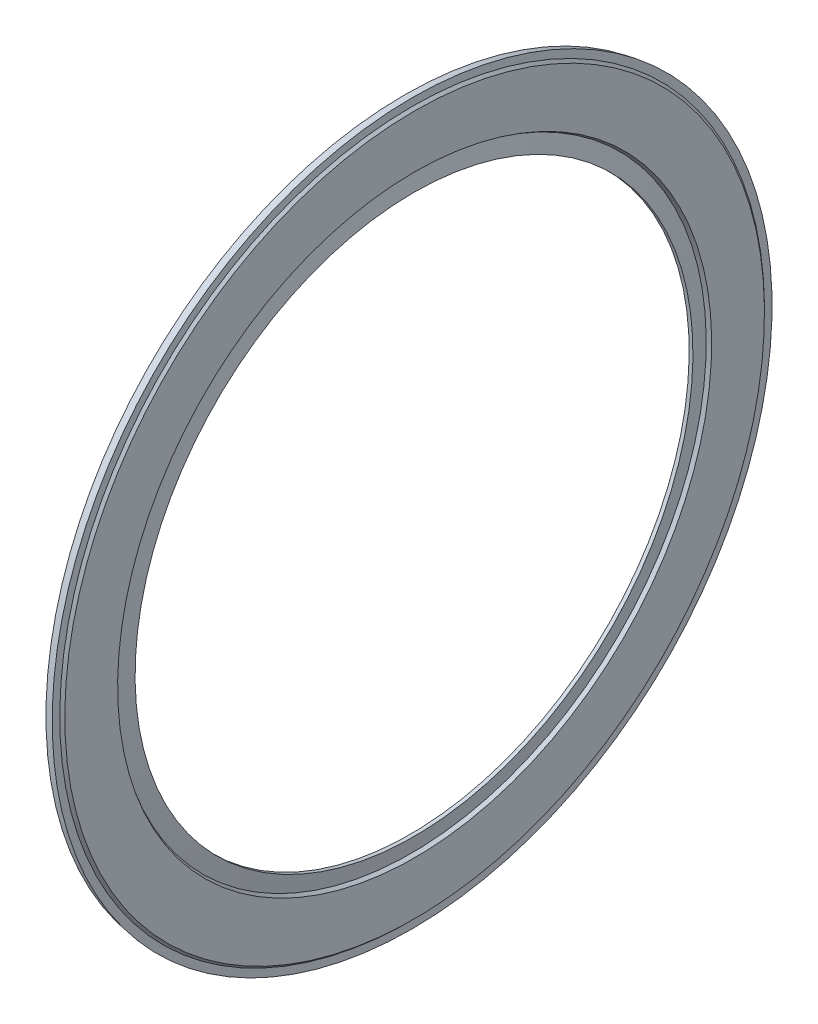
ISO-10303-21;
HEADER;
FILE_DESCRIPTION(('STEP AP214'),'2;1');
FILE_NAME('part.step','',(''),(''),'','','');
FILE_SCHEMA(('AUTOMOTIVE_DESIGN { 1 0 10303 214 1 1 1 1 }'));
ENDSEC;
DATA;
#1=APPLICATION_CONTEXT('core data for automotive mechanical design processes');
#2=APPLICATION_PROTOCOL_DEFINITION('international standard','automotive_design',2000,#1);
#3=PRODUCT_CONTEXT('',#1,'mechanical');
#4=PRODUCT('Part','Part','',(#3));
#5=PRODUCT_RELATED_PRODUCT_CATEGORY('part','',(#4));
#6=PRODUCT_DEFINITION_FORMATION('','',#4);
#7=PRODUCT_DEFINITION_CONTEXT('part definition',#1,'design');
#8=PRODUCT_DEFINITION('design','',#6,#7);
#9=PRODUCT_DEFINITION_SHAPE('','',#8);
#10=(LENGTH_UNIT() NAMED_UNIT(*) SI_UNIT(.MILLI.,.METRE.));
#11=(NAMED_UNIT(*) PLANE_ANGLE_UNIT() SI_UNIT($,.RADIAN.));
#12=(NAMED_UNIT(*) SI_UNIT($,.STERADIAN.) SOLID_ANGLE_UNIT());
#13=UNCERTAINTY_MEASURE_WITH_UNIT(LENGTH_MEASURE(1.E-05),#10,'distance_accuracy_value','');
#14=(GEOMETRIC_REPRESENTATION_CONTEXT(3) GLOBAL_UNCERTAINTY_ASSIGNED_CONTEXT((#13)) GLOBAL_UNIT_ASSIGNED_CONTEXT((#10,
#11,#12)) REPRESENTATION_CONTEXT('',''));
#15=CARTESIAN_POINT('',(0.,0.,0.));
#16=DIRECTION('',(0.,0.,1.));
#17=DIRECTION('',(1.,0.,0.));
#18=AXIS2_PLACEMENT_3D('',#15,#16,#17);
#19=CARTESIAN_POINT('',(4.83,11.9895505867204,0.));
#20=DIRECTION('',(1.,0.,0.));
#21=DIRECTION('',(0.,-1.,0.));
#22=AXIS2_PLACEMENT_3D('',#19,#20,#21);
#23=PLANE('',#22);
#24=CARTESIAN_POINT('',(4.83,0.,0.));
#25=DIRECTION('',(-1.,0.,0.));
#26=DIRECTION('',(0.,1.,0.));
#27=AXIS2_PLACEMENT_3D('',#24,#25,#26);
#28=CIRCLE('',#27,11.8620505867204);
#29=CARTESIAN_POINT('',(4.83,11.8620505867204,0.));
#30=VERTEX_POINT('',#29);
#31=EDGE_CURVE('E11',#30,#30,#28,.T.);
#32=ORIENTED_EDGE('',*,*,#31,.T.);
#33=EDGE_LOOP('',(#32));
#34=FACE_BOUND('',#33,.T.);
#35=CARTESIAN_POINT('',(4.83,0.,0.));
#36=DIRECTION('',(-1.,0.,0.));
#37=DIRECTION('',(0.,1.,0.));
#38=AXIS2_PLACEMENT_3D('',#35,#36,#37);
#39=CIRCLE('',#38,12.1170505867204);
#40=CARTESIAN_POINT('',(4.83,12.1170505867204,0.));
#41=VERTEX_POINT('',#40);
#42=EDGE_CURVE('E56',#41,#41,#39,.T.);
#43=ORIENTED_EDGE('',*,*,#42,.F.);
#44=EDGE_LOOP('',(#43));
#45=FACE_BOUND('',#44,.T.);
#46=ADVANCED_FACE('F16',(#34,#45),#23,.T.);
#47=CARTESIAN_POINT('',(4.8725,0.,0.));
#48=DIRECTION('',(-1.,0.,0.));
#49=DIRECTION('',(0.,1.,0.));
#50=AXIS2_PLACEMENT_3D('',#47,#48,#49);
#51=CONICAL_SURFACE('',#50,11.8195505867204,0.785398163397441);
#52=CARTESIAN_POINT('',(4.915,0.,0.));
#53=DIRECTION('',(-1.,0.,0.));
#54=DIRECTION('',(0.,1.,0.));
#55=AXIS2_PLACEMENT_3D('',#52,#53,#54);
#56=CIRCLE('',#55,11.7770505867204);
#57=CARTESIAN_POINT('',(4.915,11.7770505867204,0.));
#58=VERTEX_POINT('',#57);
#59=EDGE_CURVE('E26',#58,#58,#56,.T.);
#60=ORIENTED_EDGE('',*,*,#59,.T.);
#61=EDGE_LOOP('',(#60));
#62=FACE_BOUND('',#61,.T.);
#63=ORIENTED_EDGE('',*,*,#31,.F.);
#64=EDGE_LOOP('',(#63));
#65=FACE_BOUND('',#64,.T.);
#66=ADVANCED_FACE('F97',(#62,#65),#51,.T.);
#67=CARTESIAN_POINT('',(4.915,10.8880252933602,0.));
#68=DIRECTION('',(1.,0.,0.));
#69=DIRECTION('',(0.,-1.,0.));
#70=AXIS2_PLACEMENT_3D('',#67,#68,#69);
#71=PLANE('',#70);
#72=CARTESIAN_POINT('',(4.915,0.,0.));
#73=DIRECTION('',(-1.,0.,0.));
#74=DIRECTION('',(0.,1.,0.));
#75=AXIS2_PLACEMENT_3D('',#72,#73,#74);
#76=CIRCLE('',#75,9.999);
#77=CARTESIAN_POINT('',(4.915,9.999,0.));
#78=VERTEX_POINT('',#77);
#79=EDGE_CURVE('E63',#78,#78,#76,.T.);
#80=ORIENTED_EDGE('',*,*,#79,.T.);
#81=EDGE_LOOP('',(#80));
#82=FACE_BOUND('',#81,.T.);
#83=ORIENTED_EDGE('',*,*,#59,.F.);
#84=EDGE_LOOP('',(#83));
#85=FACE_BOUND('',#84,.T.);
#86=ADVANCED_FACE('F101',(#82,#85),#71,.T.);
#87=CARTESIAN_POINT('',(4.85667405535265,0.,0.));
#88=DIRECTION('',(1.,0.,0.));
#89=DIRECTION('',(0.,1.,0.));
#90=AXIS2_PLACEMENT_3D('',#87,#88,#89);
#91=CONICAL_SURFACE('',#90,9.96532550015711,0.523598775598287);
#92=CARTESIAN_POINT('',(4.7983481107053,0.,0.));
#93=DIRECTION('',(-1.,0.,0.));
#94=DIRECTION('',(0.,1.,0.));
#95=AXIS2_PLACEMENT_3D('',#92,#93,#94);
#96=CIRCLE('',#95,9.93165100031423);
#97=CARTESIAN_POINT('',(4.7983481107053,9.93165100031423,0.));
#98=VERTEX_POINT('',#97);
#99=EDGE_CURVE('E65',#98,#98,#96,.T.);
#100=ORIENTED_EDGE('',*,*,#99,.T.);
#101=EDGE_LOOP('',(#100));
#102=FACE_BOUND('',#101,.T.);
#103=ORIENTED_EDGE('',*,*,#79,.F.);
#104=EDGE_LOOP('',(#103));
#105=FACE_BOUND('',#104,.T.);
#106=ADVANCED_FACE('F125',(#102,#105),#91,.F.);
#107=CARTESIAN_POINT('',(4.84604905535265,0.,0.));
#108=DIRECTION('',(-1.,0.,0.));
#109=DIRECTION('',(0.,1.,0.));
#110=AXIS2_PLACEMENT_3D('',#107,#108,#109);
#111=CONICAL_SURFACE('',#110,9.66112550015711,1.39626340159546);
#112=CARTESIAN_POINT('',(4.89375,0.,0.));
#113=DIRECTION('',(-1.,0.,0.));
#114=DIRECTION('',(0.,1.,0.));
#115=AXIS2_PLACEMENT_3D('',#112,#113,#114);
#116=CIRCLE('',#115,9.3906);
#117=CARTESIAN_POINT('',(4.89375,9.3906,0.));
#118=VERTEX_POINT('',#117);
#119=EDGE_CURVE('E68',#118,#118,#116,.T.);
#120=ORIENTED_EDGE('',*,*,#119,.T.);
#121=EDGE_LOOP('',(#120));
#122=FACE_BOUND('',#121,.T.);
#123=ORIENTED_EDGE('',*,*,#99,.F.);
#124=EDGE_LOOP('',(#123));
#125=FACE_BOUND('',#124,.T.);
#126=ADVANCED_FACE('F121',(#122,#125),#111,.T.);
#127=CARTESIAN_POINT('',(4.83,0.,0.));
#128=DIRECTION('',(1.,0.,0.));
#129=DIRECTION('',(0.,1.,0.));
#130=AXIS2_PLACEMENT_3D('',#127,#128,#129);
#131=CYLINDRICAL_SURFACE('',#130,9.3906);
#132=CARTESIAN_POINT('',(4.76625,0.,0.));
#133=DIRECTION('',(-1.,0.,0.));
#134=DIRECTION('',(0.,1.,0.));
#135=AXIS2_PLACEMENT_3D('',#132,#133,#134);
#136=CIRCLE('',#135,9.3906);
#137=CARTESIAN_POINT('',(4.76625,9.3906,0.));
#138=VERTEX_POINT('',#137);
#139=EDGE_CURVE('E69',#138,#138,#136,.T.);
#140=ORIENTED_EDGE('',*,*,#139,.T.);
#141=EDGE_LOOP('',(#140));
#142=FACE_BOUND('',#141,.T.);
#143=ORIENTED_EDGE('',*,*,#119,.F.);
#144=EDGE_LOOP('',(#143));
#145=FACE_BOUND('',#144,.T.);
#146=ADVANCED_FACE('F124',(#142,#145),#131,.F.);
#147=CARTESIAN_POINT('',(4.71261133246849,0.,0.));
#148=DIRECTION('',(-1.,0.,0.));
#149=DIRECTION('',(0.,1.,0.));
#150=AXIS2_PLACEMENT_3D('',#147,#148,#149);
#151=CONICAL_SURFACE('',#150,9.6948,1.39626340159546);
#152=CARTESIAN_POINT('',(4.65897266493697,0.,0.));
#153=DIRECTION('',(-1.,0.,0.));
#154=DIRECTION('',(0.,1.,0.));
#155=AXIS2_PLACEMENT_3D('',#152,#153,#154);
#156=CIRCLE('',#155,9.999);
#157=CARTESIAN_POINT('',(4.65897266493697,9.999,0.));
#158=VERTEX_POINT('',#157);
#159=EDGE_CURVE('E72',#158,#158,#156,.T.);
#160=ORIENTED_EDGE('',*,*,#159,.T.);
#161=EDGE_LOOP('',(#160));
#162=FACE_BOUND('',#161,.T.);
#163=ORIENTED_EDGE('',*,*,#139,.F.);
#164=EDGE_LOOP('',(#163));
#165=FACE_BOUND('',#164,.T.);
#166=ADVANCED_FACE('F18',(#162,#165),#151,.F.);
#167=CARTESIAN_POINT('',(4.63823633246849,0.,0.));
#168=DIRECTION('',(1.,0.,0.));
#169=DIRECTION('',(0.,1.,0.));
#170=AXIS2_PLACEMENT_3D('',#167,#168,#169);
#171=CYLINDRICAL_SURFACE('',#170,9.999);
#172=CARTESIAN_POINT('',(4.6175,0.,0.));
#173=DIRECTION('',(-1.,0.,0.));
#174=DIRECTION('',(0.,1.,0.));
#175=AXIS2_PLACEMENT_3D('',#172,#173,#174);
#176=CIRCLE('',#175,9.999);
#177=CARTESIAN_POINT('',(4.6175,9.999,0.));
#178=VERTEX_POINT('',#177);
#179=EDGE_CURVE('E58',#178,#178,#176,.T.);
#180=ORIENTED_EDGE('',*,*,#179,.T.);
#181=EDGE_LOOP('',(#180));
#182=FACE_BOUND('',#181,.T.);
#183=ORIENTED_EDGE('',*,*,#159,.F.);
#184=EDGE_LOOP('',(#183));
#185=FACE_BOUND('',#184,.T.);
#186=ADVANCED_FACE('F80',(#182,#185),#171,.F.);
#187=CARTESIAN_POINT('',(4.6175,10.7916,0.));
#188=DIRECTION('',(-1.,0.,0.));
#189=DIRECTION('',(0.,1.,0.));
#190=AXIS2_PLACEMENT_3D('',#187,#188,#189);
#191=PLANE('',#190);
#192=CARTESIAN_POINT('',(4.6175,0.,0.));
#193=DIRECTION('',(-1.,0.,0.));
#194=DIRECTION('',(0.,1.,0.));
#195=AXIS2_PLACEMENT_3D('',#192,#193,#194);
#196=CIRCLE('',#195,11.5842);
#197=CARTESIAN_POINT('',(4.6175,11.5842,0.));
#198=VERTEX_POINT('',#197);
#199=EDGE_CURVE('E20',#198,#198,#196,.T.);
#200=ORIENTED_EDGE('',*,*,#199,.T.);
#201=EDGE_LOOP('',(#200));
#202=FACE_BOUND('',#201,.T.);
#203=ORIENTED_EDGE('',*,*,#179,.F.);
#204=EDGE_LOOP('',(#203));
#205=FACE_BOUND('',#204,.T.);
#206=ADVANCED_FACE('F83',(#202,#205),#191,.T.);
#207=CARTESIAN_POINT('',(4.59625,0.,0.));
#208=DIRECTION('',(-1.,0.,0.));
#209=DIRECTION('',(0.,1.,0.));
#210=AXIS2_PLACEMENT_3D('',#207,#208,#209);
#211=CONICAL_SURFACE('',#210,11.60545,0.785398163397428);
#212=CARTESIAN_POINT('',(4.575,0.,0.));
#213=DIRECTION('',(-1.,0.,0.));
#214=DIRECTION('',(0.,1.,0.));
#215=AXIS2_PLACEMENT_3D('',#212,#213,#214);
#216=CIRCLE('',#215,11.6267);
#217=CARTESIAN_POINT('',(4.575,11.6267,0.));
#218=VERTEX_POINT('',#217);
#219=EDGE_CURVE('E52',#218,#218,#216,.T.);
#220=ORIENTED_EDGE('',*,*,#219,.T.);
#221=EDGE_LOOP('',(#220));
#222=FACE_BOUND('',#221,.T.);
#223=ORIENTED_EDGE('',*,*,#199,.F.);
#224=EDGE_LOOP('',(#223));
#225=FACE_BOUND('',#224,.T.);
#226=ADVANCED_FACE('F53',(#222,#225),#211,.F.);
#227=CARTESIAN_POINT('',(4.575,11.8493936033199,0.));
#228=DIRECTION('',(-1.,0.,0.));
#229=DIRECTION('',(0.,1.,0.));
#230=AXIS2_PLACEMENT_3D('',#227,#228,#229);
#231=PLANE('',#230);
#232=CARTESIAN_POINT('',(4.575,0.,0.));
#233=DIRECTION('',(-1.,0.,0.));
#234=DIRECTION('',(0.,1.,0.));
#235=AXIS2_PLACEMENT_3D('',#232,#233,#234);
#236=CIRCLE('',#235,12.0720872066398);
#237=CARTESIAN_POINT('',(4.575,12.0720872066398,0.));
#238=VERTEX_POINT('',#237);
#239=EDGE_CURVE('E59',#238,#238,#236,.T.);
#240=ORIENTED_EDGE('',*,*,#239,.T.);
#241=EDGE_LOOP('',(#240));
#242=FACE_BOUND('',#241,.T.);
#243=ORIENTED_EDGE('',*,*,#219,.F.);
#244=EDGE_LOOP('',(#243));
#245=FACE_BOUND('',#244,.T.);
#246=ADVANCED_FACE('F92',(#242,#245),#231,.T.);
#247=CARTESIAN_POINT('',(4.7025,0.,0.));
#248=DIRECTION('',(1.,0.,0.));
#249=DIRECTION('',(0.,1.,0.));
#250=AXIS2_PLACEMENT_3D('',#247,#248,#249);
#251=CONICAL_SURFACE('',#250,12.0945688966801,0.174532925199431);
#252=ORIENTED_EDGE('',*,*,#42,.T.);
#253=EDGE_LOOP('',(#252));
#254=FACE_BOUND('',#253,.T.);
#255=ORIENTED_EDGE('',*,*,#239,.F.);
#256=EDGE_LOOP('',(#255));
#257=FACE_BOUND('',#256,.T.);
#258=ADVANCED_FACE('F106',(#254,#257),#251,.T.);
#259=CLOSED_SHELL('',(#46,#66,#86,#106,#126,#146,#166,#186,#206,#226,#246,#258));
#260=MANIFOLD_SOLID_BREP('B1',#259);
#261=ADVANCED_BREP_SHAPE_REPRESENTATION('',(#18,#260),#14);
#262=SHAPE_DEFINITION_REPRESENTATION(#9,#261);
ENDSEC;
END-ISO-10303-21;
